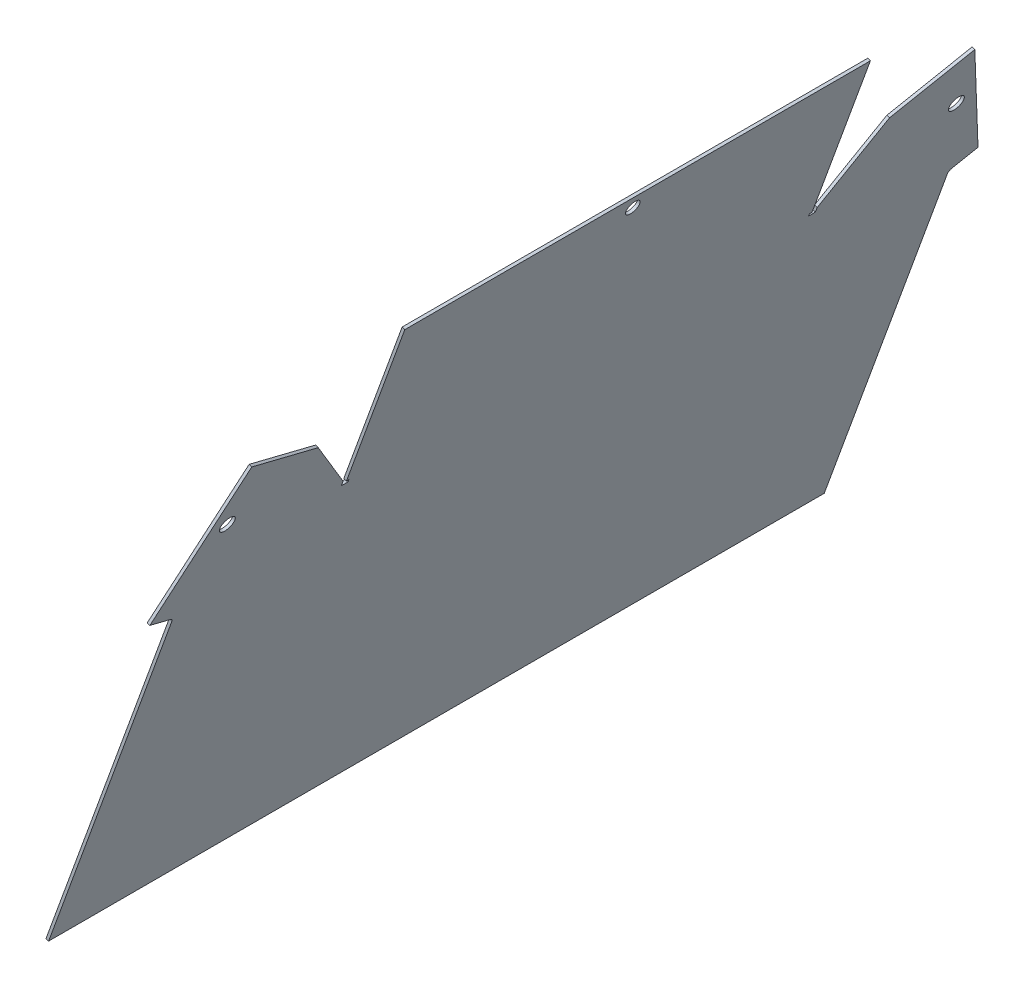
ISO-10303-21;
HEADER;
FILE_DESCRIPTION(('STEP AP214'),'2;1');
FILE_NAME('part.step','',(''),(''),'','','');
FILE_SCHEMA(('AUTOMOTIVE_DESIGN { 1 0 10303 214 1 1 1 1 }'));
ENDSEC;
DATA;
#1=APPLICATION_CONTEXT('core data for automotive mechanical design processes');
#2=APPLICATION_PROTOCOL_DEFINITION('international standard','automotive_design',2000,#1);
#3=PRODUCT_CONTEXT('',#1,'mechanical');
#4=PRODUCT('Part','Part','',(#3));
#5=PRODUCT_RELATED_PRODUCT_CATEGORY('part','',(#4));
#6=PRODUCT_DEFINITION_FORMATION('','',#4);
#7=PRODUCT_DEFINITION_CONTEXT('part definition',#1,'design');
#8=PRODUCT_DEFINITION('design','',#6,#7);
#9=PRODUCT_DEFINITION_SHAPE('','',#8);
#10=(LENGTH_UNIT() NAMED_UNIT(*) SI_UNIT(.MILLI.,.METRE.));
#11=(NAMED_UNIT(*) PLANE_ANGLE_UNIT() SI_UNIT($,.RADIAN.));
#12=(NAMED_UNIT(*) SI_UNIT($,.STERADIAN.) SOLID_ANGLE_UNIT());
#13=UNCERTAINTY_MEASURE_WITH_UNIT(LENGTH_MEASURE(1.E-05),#10,'distance_accuracy_value','');
#14=(GEOMETRIC_REPRESENTATION_CONTEXT(3) GLOBAL_UNCERTAINTY_ASSIGNED_CONTEXT((#13)) GLOBAL_UNIT_ASSIGNED_CONTEXT((#10,
#11,#12)) REPRESENTATION_CONTEXT('',''));
#15=CARTESIAN_POINT('',(0.,0.,0.));
#16=DIRECTION('',(0.,0.,1.));
#17=DIRECTION('',(1.,0.,0.));
#18=AXIS2_PLACEMENT_3D('',#15,#16,#17);
#19=CARTESIAN_POINT('',(-66.0897710828425,-21.492119605104,100.));
#20=DIRECTION('',(-0.342020143325664,-0.939692620785911,0.));
#21=DIRECTION('',(0.,0.,-1.));
#22=AXIS2_PLACEMENT_3D('',#19,#20,#21);
#23=PLANE('',#22);
#24=DIRECTION('',(0.939692620785911,-0.342020143325664,0.));
#25=VECTOR('',#24,1.);
#26=CARTESIAN_POINT('',(-66.0897710828425,-21.492119605104,-98.9));
#27=LINE('',#26,#25);
#28=CARTESIAN_POINT('',(-67.2174022277856,-21.0816954331132,-98.9));
#29=VERTEX_POINT('',#28);
#30=CARTESIAN_POINT('',(-66.0897710828425,-21.492119605104,-98.9));
#31=VERTEX_POINT('',#30);
#32=EDGE_CURVE('E65',#29,#31,#27,.T.);
#33=ORIENTED_EDGE('',*,*,#32,.F.);
#34=DIRECTION('',(0.,0.,1.));
#35=VECTOR('',#34,1.);
#36=CARTESIAN_POINT('',(-67.2174022277856,-21.0816954331132,100.));
#37=LINE('',#36,#35);
#38=CARTESIAN_POINT('',(-67.2174022277856,-21.0816954331132,-100.));
#39=VERTEX_POINT('',#38);
#40=EDGE_CURVE('E77',#29,#39,#37,.F.);
#41=ORIENTED_EDGE('',*,*,#40,.T.);
#42=DIRECTION('',(0.939692620785911,-0.342020143325664,0.));
#43=VECTOR('',#42,1.);
#44=CARTESIAN_POINT('',(-66.0897710828425,-21.492119605104,-100.));
#45=LINE('',#44,#43);
#46=CARTESIAN_POINT('',(-66.0897710828425,-21.492119605104,-100.));
#47=VERTEX_POINT('',#46);
#48=EDGE_CURVE('E328',#39,#47,#45,.T.);
#49=ORIENTED_EDGE('',*,*,#48,.T.);
#50=DIRECTION('',(0.,0.,-1.));
#51=VECTOR('',#50,1.);
#52=CARTESIAN_POINT('',(-66.0897710828425,-21.492119605104,100.));
#53=LINE('',#52,#51);
#54=EDGE_CURVE('E329',#31,#47,#53,.T.);
#55=ORIENTED_EDGE('',*,*,#54,.F.);
#56=EDGE_LOOP('',(#33,#41,#49,#55));
#57=FACE_BOUND('',#56,.T.);
#58=ADVANCED_FACE('F56',(#57),#23,.T.);
#59=CARTESIAN_POINT('',(-52.9994454834083,14.4732543926511,-100.));
#60=DIRECTION('',(0.,0.,1.));
#61=DIRECTION('',(-0.342020143325663,-0.939692620785911,0.));
#62=AXIS2_PLACEMENT_3D('',#59,#60,#61);
#63=PLANE('',#62);
#64=ORIENTED_EDGE('',*,*,#48,.F.);
#65=DIRECTION('',(0.342020143325664,0.939692620785911,0.));
#66=VECTOR('',#65,1.);
#67=CARTESIAN_POINT('',(-54.1270766283513,14.8836785646419,-100.));
#68=LINE('',#67,#66);
#69=CARTESIAN_POINT('',(-42.1503914713204,47.7893505935023,-100.));
#70=VERTEX_POINT('',#69);
#71=EDGE_CURVE('E281',#70,#39,#68,.F.);
#72=ORIENTED_EDGE('',*,*,#71,.F.);
#73=DIRECTION('',(0.93969262078591,-0.342020143325664,0.));
#74=VECTOR('',#73,1.);
#75=CARTESIAN_POINT('',(-41.0227603263773,47.3789264215115,-100.));
#76=LINE('',#75,#74);
#77=CARTESIAN_POINT('',(-41.0227603263773,47.3789264215115,-100.));
#78=VERTEX_POINT('',#77);
#79=EDGE_CURVE('E282',#70,#78,#76,.T.);
#80=ORIENTED_EDGE('',*,*,#79,.T.);
#81=DIRECTION('',(-0.342020143325663,-0.939692620785911,0.));
#82=VECTOR('',#81,1.);
#83=CARTESIAN_POINT('',(-52.9994454834083,14.4732543926511,-100.));
#84=LINE('',#83,#82);
#85=EDGE_CURVE('E312',#78,#47,#84,.T.);
#86=ORIENTED_EDGE('',*,*,#85,.T.);
#87=EDGE_LOOP('',(#64,#72,#80,#86));
#88=FACE_BOUND('',#87,.T.);
#89=ADVANCED_FACE('F352',(#88),#63,.F.);
#90=CARTESIAN_POINT('',(-52.9994454834083,14.4732543926511,100.));
#91=DIRECTION('',(0.,0.,1.));
#92=DIRECTION('',(-0.342020143325663,-0.939692620785911,0.));
#93=AXIS2_PLACEMENT_3D('',#90,#91,#92);
#94=PLANE('',#93);
#95=DIRECTION('',(-0.342020143325663,-0.939692620785911,0.));
#96=VECTOR('',#95,1.);
#97=CARTESIAN_POINT('',(-52.9994454834083,14.4732543926511,100.));
#98=LINE('',#97,#96);
#99=CARTESIAN_POINT('',(-41.0227603263773,47.3789264215115,100.));
#100=VERTEX_POINT('',#99);
#101=CARTESIAN_POINT('',(-66.0897710828425,-21.492119605104,100.));
#102=VERTEX_POINT('',#101);
#103=EDGE_CURVE('E306',#100,#102,#98,.T.);
#104=ORIENTED_EDGE('',*,*,#103,.F.);
#105=DIRECTION('',(0.93969262078591,-0.342020143325664,0.));
#106=VECTOR('',#105,1.);
#107=CARTESIAN_POINT('',(-41.0227603263773,47.3789264215115,100.));
#108=LINE('',#107,#106);
#109=CARTESIAN_POINT('',(-42.1503914713204,47.7893505935023,100.));
#110=VERTEX_POINT('',#109);
#111=EDGE_CURVE('E270',#110,#100,#108,.T.);
#112=ORIENTED_EDGE('',*,*,#111,.F.);
#113=DIRECTION('',(0.342020143325664,0.939692620785911,0.));
#114=VECTOR('',#113,1.);
#115=CARTESIAN_POINT('',(-54.1270766283513,14.8836785646419,100.));
#116=LINE('',#115,#114);
#117=CARTESIAN_POINT('',(-67.2174022277856,-21.0816954331132,100.));
#118=VERTEX_POINT('',#117);
#119=EDGE_CURVE('E317',#110,#118,#116,.F.);
#120=ORIENTED_EDGE('',*,*,#119,.T.);
#121=DIRECTION('',(0.939692620785911,-0.342020143325664,0.));
#122=VECTOR('',#121,1.);
#123=CARTESIAN_POINT('',(-66.0897710828425,-21.492119605104,100.));
#124=LINE('',#123,#122);
#125=EDGE_CURVE('E325',#118,#102,#124,.T.);
#126=ORIENTED_EDGE('',*,*,#125,.T.);
#127=EDGE_LOOP('',(#104,#112,#120,#126));
#128=FACE_BOUND('',#127,.T.);
#129=ADVANCED_FACE('F646',(#128),#94,.T.);
#130=ORIENTED_EDGE('',*,*,#125,.F.);
#131=DIRECTION('',(0.,0.,1.));
#132=VECTOR('',#131,1.);
#133=CARTESIAN_POINT('',(-67.2174022277856,-21.0816954331132,100.));
#134=LINE('',#133,#132);
#135=CARTESIAN_POINT('',(-67.2174022277856,-21.0816954331132,98.9));
#136=VERTEX_POINT('',#135);
#137=EDGE_CURVE('E314',#118,#136,#134,.F.);
#138=ORIENTED_EDGE('',*,*,#137,.T.);
#139=DIRECTION('',(0.939692620785908,-0.34202014332567,0.));
#140=VECTOR('',#139,1.);
#141=CARTESIAN_POINT('',(-66.0897710828425,-21.492119605104,98.9));
#142=LINE('',#141,#140);
#143=CARTESIAN_POINT('',(-66.0897710828425,-21.492119605104,98.9));
#144=VERTEX_POINT('',#143);
#145=EDGE_CURVE('E332',#136,#144,#142,.T.);
#146=ORIENTED_EDGE('',*,*,#145,.T.);
#147=EDGE_CURVE('E311',#102,#144,#53,.T.);
#148=ORIENTED_EDGE('',*,*,#147,.F.);
#149=EDGE_LOOP('',(#130,#138,#146,#148));
#150=FACE_BOUND('',#149,.T.);
#151=ADVANCED_FACE('F378',(#150),#23,.T.);
#152=CARTESIAN_POINT('',(-66.3364356278653,-22.1698248727339,100.));
#153=DIRECTION('',(0.93969262078591,-0.342020143325666,0.));
#154=DIRECTION('',(0.342020143325666,0.93969262078591,0.));
#155=AXIS2_PLACEMENT_3D('',#152,#153,#154);
#156=PLANE('',#155);
#157=ORIENTED_EDGE('',*,*,#85,.F.);
#158=DIRECTION('',(0.,0.,-1.));
#159=VECTOR('',#158,1.);
#160=CARTESIAN_POINT('',(-41.0227603263773,47.3789264215115,100.));
#161=LINE('',#160,#159);
#162=EDGE_CURVE('E294',#100,#78,#161,.T.);
#163=ORIENTED_EDGE('',*,*,#162,.F.);
#164=ORIENTED_EDGE('',*,*,#103,.T.);
#165=ORIENTED_EDGE('',*,*,#147,.T.);
#166=DIRECTION('',(0.342020143325666,0.93969262078591,0.));
#167=VECTOR('',#166,1.);
#168=CARTESIAN_POINT('',(-66.2778064775316,-22.0087426060704,98.9));
#169=LINE('',#168,#167);
#170=CARTESIAN_POINT('',(-66.4658418722206,-22.5253656070367,98.9));
#171=VERTEX_POINT('',#170);
#172=EDGE_CURVE('E264',#144,#171,#169,.F.);
#173=ORIENTED_EDGE('',*,*,#172,.T.);
#174=DIRECTION('',(0.,0.,-1.));
#175=VECTOR('',#174,1.);
#176=CARTESIAN_POINT('',(-66.4658418722206,-22.5253656070367,100.527433388231));
#177=LINE('',#176,#175);
#178=CARTESIAN_POINT('',(-66.4658418722206,-22.5253656070367,101.827433388231));
#179=VERTEX_POINT('',#178);
#180=EDGE_CURVE('E273',#179,#171,#177,.T.);
#181=ORIENTED_EDGE('',*,*,#180,.F.);
#182=DIRECTION('',(-0.342020143325668,-0.939692620785909,0.));
#183=VECTOR('',#182,1.);
#184=CARTESIAN_POINT('',(-66.4658418722206,-22.5253656070367,101.827433388231));
#185=LINE('',#184,#183);
#186=CARTESIAN_POINT('',(-65.7014436261222,-20.4251986864106,101.827433388231));
#187=VERTEX_POINT('',#186);
#188=EDGE_CURVE('E391',#187,#179,#185,.T.);
#189=ORIENTED_EDGE('',*,*,#188,.F.);
#190=DIRECTION('',(-0.280166499593235,-0.769751131320058,-0.573576436351046));
#191=VECTOR('',#190,1.);
#192=CARTESIAN_POINT('',(-65.7014436261222,-20.4251986864106,101.827433388231));
#193=LINE('',#192,#191);
#194=CARTESIAN_POINT('',(-55.5074652630726,7.5825266804774,122.697258260965));
#195=VERTEX_POINT('',#194);
#196=EDGE_CURVE('E422',#195,#187,#193,.T.);
#197=ORIENTED_EDGE('',*,*,#196,.F.);
#198=DIRECTION('',(-0.116977778440511,-0.321393804843271,-0.939692620785908));
#199=VECTOR('',#198,1.);
#200=CARTESIAN_POINT('',(-55.5074652630726,7.58252668047739,122.697258260965));
#201=LINE('',#200,#199);
#202=CARTESIAN_POINT('',(-51.4513023898988,18.7267425841526,155.280765756497));
#203=VERTEX_POINT('',#202);
#204=EDGE_CURVE('E430',#203,#195,#201,.T.);
#205=ORIENTED_EDGE('',*,*,#204,.F.);
#206=DIRECTION('',(0.321393804843269,0.88302222155949,-0.342020143325668));
#207=VECTOR('',#206,1.);
#208=CARTESIAN_POINT('',(-51.4513023898988,18.7267425841526,155.280765756497));
#209=LINE('',#208,#207);
#210=CARTESIAN_POINT('',(-72.6632935095545,-39.5527240387739,177.854095215992));
#211=VERTEX_POINT('',#210);
#212=EDGE_CURVE('E438',#211,#203,#209,.T.);
#213=ORIENTED_EDGE('',*,*,#212,.F.);
#214=DIRECTION('',(-0.11697777844051,-0.321393804843269,-0.939692620785909));
#215=VECTOR('',#214,1.);
#216=CARTESIAN_POINT('',(-72.6632935095545,-39.5527240387738,177.854095215992));
#217=LINE('',#216,#215);
#218=CARTESIAN_POINT('',(-73.9032094063065,-42.9593649671227,167.89374347991));
#219=VERTEX_POINT('',#218);
#220=EDGE_CURVE('E450',#211,#219,#217,.T.);
#221=ORIENTED_EDGE('',*,*,#220,.T.);
#222=CARTESIAN_POINT('',(-74.545997015993,-44.7254094102417,168.577783766561));
#223=DIRECTION('',(-0.939692620785909,0.342020143325668,0.));
#224=DIRECTION('',(0.11697777844051,0.321393804843269,0.939692620785909));
#225=AXIS2_PLACEMENT_3D('',#222,#223,#224);
#226=CIRCLE('',#225,2.);
#227=CARTESIAN_POINT('',(-74.545997015993,-44.7254094102417,166.577783766561));
#228=VERTEX_POINT('',#227);
#229=EDGE_CURVE('E460',#219,#228,#226,.T.);
#230=ORIENTED_EDGE('',*,*,#229,.T.);
#231=DIRECTION('',(-0.342020143325668,-0.939692620785909,0.));
#232=VECTOR('',#231,1.);
#233=CARTESIAN_POINT('',(-51.4513023898988,18.7267425841526,166.577783766561));
#234=LINE('',#233,#232);
#235=CARTESIAN_POINT('',(-127.421623785874,-190.,166.577783766561));
#236=VERTEX_POINT('',#235);
#237=EDGE_CURVE('E456',#228,#236,#234,.T.);
#238=ORIENTED_EDGE('',*,*,#237,.T.);
#239=DIRECTION('',(0.,0.,1.));
#240=VECTOR('',#239,1.);
#241=CARTESIAN_POINT('',(-127.421623785874,-190.,236.126693153945));
#242=LINE('',#241,#240);
#243=CARTESIAN_POINT('',(-127.421623785873,-190.,-166.577783766561));
#244=VERTEX_POINT('',#243);
#245=EDGE_CURVE('E411',#244,#236,#242,.T.);
#246=ORIENTED_EDGE('',*,*,#245,.F.);
#247=DIRECTION('',(0.342020143325663,0.939692620785911,0.));
#248=VECTOR('',#247,1.);
#249=CARTESIAN_POINT('',(-51.4513023898989,18.7267425841523,-166.577783766562));
#250=LINE('',#249,#248);
#251=CARTESIAN_POINT('',(-74.5459970159929,-44.7254094102421,-166.577783766561));
#252=VERTEX_POINT('',#251);
#253=EDGE_CURVE('E530',#244,#252,#250,.T.);
#254=ORIENTED_EDGE('',*,*,#253,.T.);
#255=CARTESIAN_POINT('',(-74.5459970159929,-44.7254094102421,-168.577783766561));
#256=DIRECTION('',(-0.939692620785911,0.342020143325662,0.));
#257=DIRECTION('',(-0.116977778440517,-0.321393804843261,0.939692620785911));
#258=AXIS2_PLACEMENT_3D('',#255,#256,#257);
#259=CIRCLE('',#258,2.);
#260=CARTESIAN_POINT('',(-73.9032094063063,-42.9593649671231,-167.89374347991));
#261=VERTEX_POINT('',#260);
#262=EDGE_CURVE('E541',#252,#261,#259,.T.);
#263=ORIENTED_EDGE('',*,*,#262,.T.);
#264=DIRECTION('',(0.116977778440517,0.321393804843261,-0.939692620785911));
#265=VECTOR('',#264,1.);
#266=CARTESIAN_POINT('',(-72.6632935095543,-39.5527240387743,-177.854095215992));
#267=LINE('',#266,#265);
#268=CARTESIAN_POINT('',(-72.6632935095543,-39.5527240387743,-177.854095215992));
#269=VERTEX_POINT('',#268);
#270=EDGE_CURVE('E546',#261,#269,#267,.T.);
#271=ORIENTED_EDGE('',*,*,#270,.T.);
#272=DIRECTION('',(-0.321393804843261,-0.883022221559495,-0.342020143325663));
#273=VECTOR('',#272,1.);
#274=CARTESIAN_POINT('',(-51.4513023898991,18.7267425841523,-155.280765756498));
#275=LINE('',#274,#273);
#276=CARTESIAN_POINT('',(-51.451302389899,18.7267425841524,-155.280765756498));
#277=VERTEX_POINT('',#276);
#278=EDGE_CURVE('E552',#269,#277,#275,.F.);
#279=ORIENTED_EDGE('',*,*,#278,.T.);
#280=DIRECTION('',(0.116977778440518,0.321393804843263,-0.93969262078591));
#281=VECTOR('',#280,1.);
#282=CARTESIAN_POINT('',(-51.451302389899,18.7267425841525,-155.280765756498));
#283=LINE('',#282,#281);
#284=CARTESIAN_POINT('',(-55.5074652630731,7.5825266804775,-122.697258260965));
#285=VERTEX_POINT('',#284);
#286=EDGE_CURVE('E557',#277,#285,#283,.F.);
#287=ORIENTED_EDGE('',*,*,#286,.T.);
#288=DIRECTION('',(0.280166499593236,0.769751131320054,-0.573576436351051));
#289=VECTOR('',#288,1.);
#290=CARTESIAN_POINT('',(-47.5496703983043,29.4463883800816,-138.989012008732));
#291=LINE('',#290,#289);
#292=CARTESIAN_POINT('',(-65.7014436261227,-20.4251986864103,-101.827433388231));
#293=VERTEX_POINT('',#292);
#294=EDGE_CURVE('E563',#285,#293,#291,.F.);
#295=ORIENTED_EDGE('',*,*,#294,.T.);
#296=DIRECTION('',(0.342020143325663,0.939692620785911,0.));
#297=VECTOR('',#296,1.);
#298=CARTESIAN_POINT('',(-51.4513023898996,18.7267425841527,-101.827433388231));
#299=LINE('',#298,#297);
#300=CARTESIAN_POINT('',(-66.4658418722211,-22.5253656070365,-101.827433388231));
#301=VERTEX_POINT('',#300);
#302=EDGE_CURVE('E569',#293,#301,#299,.F.);
#303=ORIENTED_EDGE('',*,*,#302,.T.);
#304=DIRECTION('',(0.,0.,1.));
#305=VECTOR('',#304,1.);
#306=CARTESIAN_POINT('',(-66.4658418722207,-22.5253656070366,-100.313716694115));
#307=LINE('',#306,#305);
#308=CARTESIAN_POINT('',(-66.4658418722207,-22.5253656070366,-98.9));
#309=VERTEX_POINT('',#308);
#310=EDGE_CURVE('E227',#301,#309,#307,.T.);
#311=ORIENTED_EDGE('',*,*,#310,.T.);
#312=DIRECTION('',(0.342020143325666,0.93969262078591,0.));
#313=VECTOR('',#312,1.);
#314=CARTESIAN_POINT('',(-66.2778064775316,-22.0087426060704,-98.9));
#315=LINE('',#314,#313);
#316=EDGE_CURVE('E258',#309,#31,#315,.T.);
#317=ORIENTED_EDGE('',*,*,#316,.T.);
#318=ORIENTED_EDGE('',*,*,#54,.T.);
#319=EDGE_LOOP('',(#157,#163,#164,#165,#173,#181,#189,#197,#205,#213,#221,#230,#238,#246,#254,
#263,#271,#279,#287,#295,#303,#311,#317,#318));
#320=FACE_BOUND('',#319,.T.);
#321=CARTESIAN_POINT('',(-43.0748811863313,41.740770696796,0.));
#322=DIRECTION('',(0.93969262078591,-0.342020143325664,0.));
#323=DIRECTION('',(0.342020143325664,0.93969262078591,0.));
#324=AXIS2_PLACEMENT_3D('',#321,#322,#323);
#325=CIRCLE('',#324,3.);
#326=CARTESIAN_POINT('',(-42.0488207563543,44.5598485591537,0.));
#327=VERTEX_POINT('',#326);
#328=EDGE_CURVE('E286',#327,#327,#325,.F.);
#329=ORIENTED_EDGE('',*,*,#328,.T.);
#330=EDGE_LOOP('',(#329));
#331=FACE_BOUND('',#330,.T.);
#332=CARTESIAN_POINT('',(-60.6701006429815,-6.60169745070006,156.577783766561));
#333=DIRECTION('',(-0.939692620785909,0.342020143325668,0.));
#334=DIRECTION('',(0.11697777844051,0.321393804843269,0.939692620785909));
#335=AXIS2_PLACEMENT_3D('',#332,#333,#334);
#336=CIRCLE('',#335,3.25);
#337=CARTESIAN_POINT('',(-60.2899228630499,-5.55716758495943,159.631784784115));
#338=VERTEX_POINT('',#337);
#339=EDGE_CURVE('E520',#338,#338,#336,.T.);
#340=ORIENTED_EDGE('',*,*,#339,.T.);
#341=EDGE_LOOP('',(#340));
#342=FACE_BOUND('',#341,.T.);
#343=CARTESIAN_POINT('',(-60.6701006429816,-6.60169745070029,-156.577783766562));
#344=DIRECTION('',(-0.939692620785911,0.342020143325662,0.));
#345=DIRECTION('',(-0.116977778440517,-0.321393804843261,0.939692620785911));
#346=AXIS2_PLACEMENT_3D('',#343,#344,#345);
#347=CIRCLE('',#346,3.25);
#348=CARTESIAN_POINT('',(-61.0502784229133,-7.64622731644089,-153.523782749007));
#349=VERTEX_POINT('',#348);
#350=EDGE_CURVE('E527',#349,#349,#347,.T.);
#351=ORIENTED_EDGE('',*,*,#350,.T.);
#352=EDGE_LOOP('',(#351));
#353=FACE_BOUND('',#352,.T.);
#354=ADVANCED_FACE('F58',(#320,#331,#342,#353),#156,.T.);
#355=CARTESIAN_POINT('',(-54.1270766283513,14.8836785646419,100.));
#356=DIRECTION('',(0.939692620785911,-0.342020143325664,0.));
#357=DIRECTION('',(0.342020143325664,0.939692620785911,0.));
#358=AXIS2_PLACEMENT_3D('',#355,#356,#357);
#359=PLANE('',#358);
#360=ORIENTED_EDGE('',*,*,#71,.T.);
#361=ORIENTED_EDGE('',*,*,#40,.F.);
#362=DIRECTION('',(0.342020143325666,0.93969262078591,0.));
#363=VECTOR('',#362,1.);
#364=CARTESIAN_POINT('',(-67.4054376224747,-21.5983184340796,-98.9));
#365=LINE('',#364,#363);
#366=CARTESIAN_POINT('',(-67.5934730171637,-22.1149414350459,-98.9000000000001));
#367=VERTEX_POINT('',#366);
#368=EDGE_CURVE('E72',#367,#29,#365,.T.);
#369=ORIENTED_EDGE('',*,*,#368,.F.);
#370=DIRECTION('',(0.,0.,1.));
#371=VECTOR('',#370,1.);
#372=CARTESIAN_POINT('',(-67.5934730171638,-22.1149414350458,-100.313716694115));
#373=LINE('',#372,#371);
#374=CARTESIAN_POINT('',(-67.5934730171642,-22.1149414350457,-101.827433388231));
#375=VERTEX_POINT('',#374);
#376=EDGE_CURVE('E217',#375,#367,#373,.T.);
#377=ORIENTED_EDGE('',*,*,#376,.F.);
#378=DIRECTION('',(0.342020143325663,0.939692620785911,0.));
#379=VECTOR('',#378,1.);
#380=CARTESIAN_POINT('',(-52.5789335348427,19.1371667561435,-101.827433388231));
#381=LINE('',#380,#379);
#382=CARTESIAN_POINT('',(-66.8290747710658,-20.0147745144195,-101.827433388231));
#383=VERTEX_POINT('',#382);
#384=EDGE_CURVE('E223',#383,#375,#381,.F.);
#385=ORIENTED_EDGE('',*,*,#384,.F.);
#386=DIRECTION('',(0.280166499593236,0.769751131320054,-0.573576436351051));
#387=VECTOR('',#386,1.);
#388=CARTESIAN_POINT('',(-48.6773015432474,29.8568125520724,-138.989012008732));
#389=LINE('',#388,#387);
#390=CARTESIAN_POINT('',(-56.6350964080162,7.9929508524683,-122.697258260965));
#391=VERTEX_POINT('',#390);
#392=EDGE_CURVE('E238',#391,#383,#389,.F.);
#393=ORIENTED_EDGE('',*,*,#392,.F.);
#394=DIRECTION('',(0.116977778440517,0.321393804843261,-0.939692620785911));
#395=VECTOR('',#394,1.);
#396=CARTESIAN_POINT('',(-52.5789335348421,19.1371667561433,-155.280765756498));
#397=LINE('',#396,#395);
#398=CARTESIAN_POINT('',(-52.5789335348421,19.1371667561432,-155.280765756498));
#399=VERTEX_POINT('',#398);
#400=EDGE_CURVE('E1220',#399,#391,#397,.F.);
#401=ORIENTED_EDGE('',*,*,#400,.F.);
#402=DIRECTION('',(-0.321393804843261,-0.883022221559495,-0.342020143325662));
#403=VECTOR('',#402,1.);
#404=CARTESIAN_POINT('',(-52.5789335348421,19.1371667561433,-155.280765756499));
#405=LINE('',#404,#403);
#406=CARTESIAN_POINT('',(-73.7909246544974,-39.1422998667835,-177.854095215992));
#407=VERTEX_POINT('',#406);
#408=EDGE_CURVE('E1213',#407,#399,#405,.F.);
#409=ORIENTED_EDGE('',*,*,#408,.F.);
#410=DIRECTION('',(0.116977778440517,0.321393804843261,-0.939692620785911));
#411=VECTOR('',#410,1.);
#412=CARTESIAN_POINT('',(-73.7909246544974,-39.1422998667835,-177.854095215992));
#413=LINE('',#412,#411);
#414=CARTESIAN_POINT('',(-75.0308405512494,-42.5489407951323,-167.89374347991));
#415=VERTEX_POINT('',#414);
#416=EDGE_CURVE('E1206',#415,#407,#413,.T.);
#417=ORIENTED_EDGE('',*,*,#416,.F.);
#418=CARTESIAN_POINT('',(-75.6736281609359,-44.3149852382513,-168.577783766561));
#419=DIRECTION('',(-0.939692620785911,0.342020143325662,0.));
#420=DIRECTION('',(-0.116977778440517,-0.321393804843261,0.939692620785911));
#421=AXIS2_PLACEMENT_3D('',#418,#419,#420);
#422=CIRCLE('',#421,2.);
#423=CARTESIAN_POINT('',(-75.673628160936,-44.3149852382513,-166.577783766561));
#424=VERTEX_POINT('',#423);
#425=EDGE_CURVE('E1199',#424,#415,#422,.T.);
#426=ORIENTED_EDGE('',*,*,#425,.F.);
#427=DIRECTION('',(0.342020143325663,0.939692620785911,0.));
#428=VECTOR('',#427,1.);
#429=CARTESIAN_POINT('',(-52.578933534842,19.1371667561431,-166.577783766562));
#430=LINE('',#429,#428);
#431=CARTESIAN_POINT('',(-128.549254930816,-189.58957582801,-166.577783766561));
#432=VERTEX_POINT('',#431);
#433=EDGE_CURVE('E1189',#432,#424,#430,.T.);
#434=ORIENTED_EDGE('',*,*,#433,.F.);
#435=DIRECTION('',(0.,0.,1.));
#436=VECTOR('',#435,1.);
#437=CARTESIAN_POINT('',(-128.549254930817,-189.589575828009,236.126693153945));
#438=LINE('',#437,#436);
#439=CARTESIAN_POINT('',(-128.549254930817,-189.589575828009,166.577783766561));
#440=VERTEX_POINT('',#439);
#441=EDGE_CURVE('E496',#432,#440,#438,.T.);
#442=ORIENTED_EDGE('',*,*,#441,.T.);
#443=DIRECTION('',(-0.342020143325668,-0.939692620785909,0.));
#444=VECTOR('',#443,1.);
#445=CARTESIAN_POINT('',(-52.5789335348419,19.1371667561434,166.577783766561));
#446=LINE('',#445,#444);
#447=CARTESIAN_POINT('',(-75.6736281609361,-44.3149852382509,166.577783766561));
#448=VERTEX_POINT('',#447);
#449=EDGE_CURVE('E426',#448,#440,#446,.T.);
#450=ORIENTED_EDGE('',*,*,#449,.F.);
#451=CARTESIAN_POINT('',(-75.6736281609361,-44.3149852382509,168.577783766561));
#452=DIRECTION('',(-0.939692620785909,0.342020143325668,0.));
#453=DIRECTION('',(0.11697777844051,0.321393804843269,0.939692620785909));
#454=AXIS2_PLACEMENT_3D('',#451,#452,#453);
#455=CIRCLE('',#454,2.);
#456=CARTESIAN_POINT('',(-75.0308405512496,-42.5489407951319,167.89374347991));
#457=VERTEX_POINT('',#456);
#458=EDGE_CURVE('E477',#457,#448,#455,.T.);
#459=ORIENTED_EDGE('',*,*,#458,.F.);
#460=DIRECTION('',(0.11697777844051,0.321393804843269,0.939692620785909));
#461=VECTOR('',#460,1.);
#462=CARTESIAN_POINT('',(-73.7909246544976,-39.142299866783,177.854095215992));
#463=LINE('',#462,#461);
#464=CARTESIAN_POINT('',(-73.7909246544977,-39.1422998667831,177.854095215992));
#465=VERTEX_POINT('',#464);
#466=EDGE_CURVE('E505',#465,#457,#463,.F.);
#467=ORIENTED_EDGE('',*,*,#466,.F.);
#468=DIRECTION('',(0.321393804843269,0.88302222155949,-0.342020143325668));
#469=VECTOR('',#468,1.);
#470=CARTESIAN_POINT('',(-52.5789335348419,19.1371667561433,155.280765756498));
#471=LINE('',#470,#469);
#472=CARTESIAN_POINT('',(-52.5789335348419,19.1371667561434,155.280765756497));
#473=VERTEX_POINT('',#472);
#474=EDGE_CURVE('E402',#465,#473,#471,.T.);
#475=ORIENTED_EDGE('',*,*,#474,.T.);
#476=DIRECTION('',(0.11697777844051,0.321393804843269,0.939692620785909));
#477=VECTOR('',#476,1.);
#478=CARTESIAN_POINT('',(-52.5789335348418,19.1371667561435,155.280765756498));
#479=LINE('',#478,#477);
#480=CARTESIAN_POINT('',(-56.6350964080156,7.9929508524682,122.697258260965));
#481=VERTEX_POINT('',#480);
#482=EDGE_CURVE('E408',#473,#481,#479,.F.);
#483=ORIENTED_EDGE('',*,*,#482,.T.);
#484=DIRECTION('',(-0.280166499593235,-0.769751131320058,-0.573576436351046));
#485=VECTOR('',#484,1.);
#486=CARTESIAN_POINT('',(-66.8290747710653,-20.0147745144198,101.827433388231));
#487=LINE('',#486,#485);
#488=CARTESIAN_POINT('',(-66.8290747710653,-20.0147745144198,101.827433388231));
#489=VERTEX_POINT('',#488);
#490=EDGE_CURVE('E612',#481,#489,#487,.T.);
#491=ORIENTED_EDGE('',*,*,#490,.T.);
#492=DIRECTION('',(-0.342020143325668,-0.939692620785909,0.));
#493=VECTOR('',#492,1.);
#494=CARTESIAN_POINT('',(-67.5934730171637,-22.1149414350459,101.827433388231));
#495=LINE('',#494,#493);
#496=CARTESIAN_POINT('',(-67.5934730171637,-22.1149414350459,101.827433388231));
#497=VERTEX_POINT('',#496);
#498=EDGE_CURVE('E616',#489,#497,#495,.T.);
#499=ORIENTED_EDGE('',*,*,#498,.T.);
#500=DIRECTION('',(0.,0.,-1.));
#501=VECTOR('',#500,1.);
#502=CARTESIAN_POINT('',(-67.5934730171637,-22.1149414350459,100.527433388231));
#503=LINE('',#502,#501);
#504=CARTESIAN_POINT('',(-67.5934730171637,-22.1149414350459,98.9));
#505=VERTEX_POINT('',#504);
#506=EDGE_CURVE('E621',#497,#505,#503,.T.);
#507=ORIENTED_EDGE('',*,*,#506,.T.);
#508=DIRECTION('',(0.342020143325666,0.93969262078591,0.));
#509=VECTOR('',#508,1.);
#510=CARTESIAN_POINT('',(-67.4054376224747,-21.5983184340796,98.9));
#511=LINE('',#510,#509);
#512=EDGE_CURVE('E265',#136,#505,#511,.F.);
#513=ORIENTED_EDGE('',*,*,#512,.F.);
#514=ORIENTED_EDGE('',*,*,#137,.F.);
#515=ORIENTED_EDGE('',*,*,#119,.F.);
#516=DIRECTION('',(0.,0.,1.));
#517=VECTOR('',#516,1.);
#518=CARTESIAN_POINT('',(-42.1503914713204,47.7893505935023,100.));
#519=LINE('',#518,#517);
#520=EDGE_CURVE('E277',#110,#70,#519,.F.);
#521=ORIENTED_EDGE('',*,*,#520,.T.);
#522=EDGE_LOOP('',(#360,#361,#369,#377,#385,#393,#401,#409,#417,#426,#434,#442,#450,#459,#467,
#475,#483,#491,#499,#507,#513,#514,#515,#521));
#523=FACE_BOUND('',#522,.T.);
#524=CARTESIAN_POINT('',(-44.2025123312744,42.1511948687868,0.));
#525=DIRECTION('',(0.93969262078591,-0.342020143325664,0.));
#526=DIRECTION('',(0.342020143325664,0.93969262078591,0.));
#527=AXIS2_PLACEMENT_3D('',#524,#525,#526);
#528=CIRCLE('',#527,3.);
#529=CARTESIAN_POINT('',(-43.1764519012974,44.9702727311445,0.));
#530=VERTEX_POINT('',#529);
#531=EDGE_CURVE('E290',#530,#530,#528,.F.);
#532=ORIENTED_EDGE('',*,*,#531,.F.);
#533=EDGE_LOOP('',(#532));
#534=FACE_BOUND('',#533,.T.);
#535=CARTESIAN_POINT('',(-61.7977317879246,-6.19127327870925,156.577783766561));
#536=DIRECTION('',(-0.939692620785909,0.342020143325668,0.));
#537=DIRECTION('',(0.11697777844051,0.321393804843269,0.939692620785909));
#538=AXIS2_PLACEMENT_3D('',#535,#536,#537);
#539=CIRCLE('',#538,3.25);
#540=CARTESIAN_POINT('',(-61.4175540079929,-5.14674341296863,159.631784784115));
#541=VERTEX_POINT('',#540);
#542=EDGE_CURVE('E470',#541,#541,#539,.T.);
#543=ORIENTED_EDGE('',*,*,#542,.F.);
#544=EDGE_LOOP('',(#543));
#545=FACE_BOUND('',#544,.T.);
#546=CARTESIAN_POINT('',(-61.7977317879247,-6.19127327870949,-156.577783766562));
#547=DIRECTION('',(-0.939692620785911,0.342020143325662,0.));
#548=DIRECTION('',(-0.116977778440517,-0.321393804843261,0.939692620785911));
#549=AXIS2_PLACEMENT_3D('',#546,#547,#548);
#550=CIRCLE('',#549,3.25);
#551=CARTESIAN_POINT('',(-62.1779095678564,-7.23580314445009,-153.523782749007));
#552=VERTEX_POINT('',#551);
#553=EDGE_CURVE('E531',#552,#552,#550,.T.);
#554=ORIENTED_EDGE('',*,*,#553,.F.);
#555=EDGE_LOOP('',(#554));
#556=FACE_BOUND('',#555,.T.);
#557=ADVANCED_FACE('F219',(#523,#534,#545,#556),#359,.F.);
#558=CARTESIAN_POINT('',(-41.0227603263773,47.3789264215115,100.));
#559=DIRECTION('',(-0.342020143325664,-0.93969262078591,0.));
#560=DIRECTION('',(0.,0.,-1.));
#561=AXIS2_PLACEMENT_3D('',#558,#559,#560);
#562=PLANE('',#561);
#563=ORIENTED_EDGE('',*,*,#79,.F.);
#564=ORIENTED_EDGE('',*,*,#520,.F.);
#565=ORIENTED_EDGE('',*,*,#111,.T.);
#566=ORIENTED_EDGE('',*,*,#162,.T.);
#567=EDGE_LOOP('',(#563,#564,#565,#566));
#568=FACE_BOUND('',#567,.T.);
#569=ADVANCED_FACE('F375',(#568),#562,.F.);
#570=CARTESIAN_POINT('',(-43.0748811863313,41.740770696796,0.));
#571=DIRECTION('',(0.93969262078591,-0.342020143325664,0.));
#572=DIRECTION('',(0.342020143325664,0.93969262078591,0.));
#573=AXIS2_PLACEMENT_3D('',#570,#571,#572);
#574=CYLINDRICAL_SURFACE('',#573,3.);
#575=ORIENTED_EDGE('',*,*,#328,.F.);
#576=EDGE_LOOP('',(#575));
#577=FACE_BOUND('',#576,.T.);
#578=ORIENTED_EDGE('',*,*,#531,.T.);
#579=EDGE_LOOP('',(#578));
#580=FACE_BOUND('',#579,.T.);
#581=ADVANCED_FACE('F736',(#577,#580),#574,.F.);
#582=CARTESIAN_POINT('',(-66.8416220500031,-21.803530520075,-98.9));
#583=DIRECTION('',(0.,0.,-1.));
#584=DIRECTION('',(0.342020143325666,0.93969262078591,0.));
#585=AXIS2_PLACEMENT_3D('',#582,#583,#584);
#586=PLANE('',#585);
#587=DIRECTION('',(0.939692620785909,-0.342020143325669,0.));
#588=VECTOR('',#587,1.);
#589=CARTESIAN_POINT('',(-66.4658418722206,-22.5253656070367,-98.9));
#590=LINE('',#589,#588);
#591=EDGE_CURVE('E13',#367,#309,#590,.T.);
#592=ORIENTED_EDGE('',*,*,#591,.F.);
#593=ORIENTED_EDGE('',*,*,#368,.T.);
#594=ORIENTED_EDGE('',*,*,#32,.T.);
#595=ORIENTED_EDGE('',*,*,#316,.F.);
#596=EDGE_LOOP('',(#592,#593,#594,#595));
#597=FACE_BOUND('',#596,.T.);
#598=ADVANCED_FACE('F751',(#597),#586,.T.);
#599=CARTESIAN_POINT('',(-66.8416220500031,-21.803530520075,98.9));
#600=DIRECTION('',(0.,0.,-1.));
#601=DIRECTION('',(0.342020143325666,0.93969262078591,0.));
#602=AXIS2_PLACEMENT_3D('',#599,#600,#601);
#603=PLANE('',#602);
#604=ORIENTED_EDGE('',*,*,#512,.T.);
#605=DIRECTION('',(0.939692620785913,-0.342020143325656,0.));
#606=VECTOR('',#605,1.);
#607=CARTESIAN_POINT('',(-66.4658418722206,-22.5253656070367,98.9));
#608=LINE('',#607,#606);
#609=EDGE_CURVE('E249',#505,#171,#608,.T.);
#610=ORIENTED_EDGE('',*,*,#609,.T.);
#611=ORIENTED_EDGE('',*,*,#172,.F.);
#612=ORIENTED_EDGE('',*,*,#145,.F.);
#613=EDGE_LOOP('',(#604,#610,#611,#612));
#614=FACE_BOUND('',#613,.T.);
#615=ADVANCED_FACE('F385',(#614),#603,.F.);
#616=CARTESIAN_POINT('',(-72.6632935095545,-39.5527240387738,177.854095215992));
#617=DIRECTION('',(0.321393804843269,0.88302222155949,-0.342020143325668));
#618=DIRECTION('',(-0.11697777844051,-0.321393804843269,-0.939692620785909));
#619=AXIS2_PLACEMENT_3D('',#616,#617,#618);
#620=PLANE('',#619);
#621=DIRECTION('',(0.939692620785909,-0.342020143325668,0.));
#622=VECTOR('',#621,1.);
#623=CARTESIAN_POINT('',(-72.6632935095545,-39.5527240387739,177.854095215992));
#624=LINE('',#623,#622);
#625=EDGE_CURVE('E443',#465,#211,#624,.T.);
#626=ORIENTED_EDGE('',*,*,#625,.F.);
#627=ORIENTED_EDGE('',*,*,#466,.T.);
#628=DIRECTION('',(0.939692620785909,-0.342020143325668,0.));
#629=VECTOR('',#628,1.);
#630=CARTESIAN_POINT('',(-73.9032094063065,-42.9593649671227,167.89374347991));
#631=LINE('',#630,#629);
#632=EDGE_CURVE('E501',#457,#219,#631,.T.);
#633=ORIENTED_EDGE('',*,*,#632,.T.);
#634=ORIENTED_EDGE('',*,*,#220,.F.);
#635=EDGE_LOOP('',(#626,#627,#633,#634));
#636=FACE_BOUND('',#635,.T.);
#637=ADVANCED_FACE('F600',(#636),#620,.F.);
#638=CARTESIAN_POINT('',(-51.4513023898988,18.7267425841526,155.280765756497));
#639=DIRECTION('',(0.11697777844051,0.321393804843269,0.939692620785909));
#640=DIRECTION('',(0.321393804843269,0.88302222155949,-0.342020143325668));
#641=AXIS2_PLACEMENT_3D('',#638,#639,#640);
#642=PLANE('',#641);
#643=DIRECTION('',(0.939692620785909,-0.342020143325668,0.));
#644=VECTOR('',#643,1.);
#645=CARTESIAN_POINT('',(-51.4513023898988,18.7267425841526,155.280765756497));
#646=LINE('',#645,#644);
#647=EDGE_CURVE('E435',#473,#203,#646,.T.);
#648=ORIENTED_EDGE('',*,*,#647,.F.);
#649=ORIENTED_EDGE('',*,*,#474,.F.);
#650=ORIENTED_EDGE('',*,*,#625,.T.);
#651=ORIENTED_EDGE('',*,*,#212,.T.);
#652=EDGE_LOOP('',(#648,#649,#650,#651));
#653=FACE_BOUND('',#652,.T.);
#654=ADVANCED_FACE('F605',(#653),#642,.T.);
#655=CARTESIAN_POINT('',(-55.5074652630726,7.58252668047739,122.697258260965));
#656=DIRECTION('',(0.321393804843269,0.88302222155949,-0.342020143325669));
#657=DIRECTION('',(-0.116977778440511,-0.321393804843271,-0.939692620785908));
#658=AXIS2_PLACEMENT_3D('',#655,#656,#657);
#659=PLANE('',#658);
#660=DIRECTION('',(0.939692620785909,-0.342020143325668,0.));
#661=VECTOR('',#660,1.);
#662=CARTESIAN_POINT('',(-55.5074652630726,7.5825266804774,122.697258260965));
#663=LINE('',#662,#661);
#664=EDGE_CURVE('E427',#481,#195,#663,.T.);
#665=ORIENTED_EDGE('',*,*,#664,.F.);
#666=ORIENTED_EDGE('',*,*,#482,.F.);
#667=ORIENTED_EDGE('',*,*,#647,.T.);
#668=ORIENTED_EDGE('',*,*,#204,.T.);
#669=EDGE_LOOP('',(#665,#666,#667,#668));
#670=FACE_BOUND('',#669,.T.);
#671=ADVANCED_FACE('F607',(#670),#659,.T.);
#672=CARTESIAN_POINT('',(-65.7014436261222,-20.4251986864106,101.827433388231));
#673=DIRECTION('',(0.19617469496901,0.538985544695757,-0.819152044288992));
#674=DIRECTION('',(-0.280166499593235,-0.769751131320058,-0.573576436351046));
#675=AXIS2_PLACEMENT_3D('',#672,#673,#674);
#676=PLANE('',#675);
#677=DIRECTION('',(0.939692620785909,-0.342020143325668,0.));
#678=VECTOR('',#677,1.);
#679=CARTESIAN_POINT('',(-65.7014436261222,-20.4251986864106,101.827433388231));
#680=LINE('',#679,#678);
#681=EDGE_CURVE('E400',#489,#187,#680,.T.);
#682=ORIENTED_EDGE('',*,*,#681,.F.);
#683=ORIENTED_EDGE('',*,*,#490,.F.);
#684=ORIENTED_EDGE('',*,*,#664,.T.);
#685=ORIENTED_EDGE('',*,*,#196,.T.);
#686=EDGE_LOOP('',(#682,#683,#684,#685));
#687=FACE_BOUND('',#686,.T.);
#688=ADVANCED_FACE('F609',(#687),#676,.T.);
#689=CARTESIAN_POINT('',(-51.4513023898988,18.7267425841526,166.577783766561));
#690=DIRECTION('',(0.,0.,-1.));
#691=DIRECTION('',(-0.342020143325668,-0.939692620785909,0.));
#692=AXIS2_PLACEMENT_3D('',#689,#690,#691);
#693=PLANE('',#692);
#694=DIRECTION('',(0.939692620785909,-0.342020143325668,0.));
#695=VECTOR('',#694,1.);
#696=CARTESIAN_POINT('',(-74.545997015993,-44.7254094102417,166.577783766561));
#697=LINE('',#696,#695);
#698=EDGE_CURVE('E474',#448,#228,#697,.T.);
#699=ORIENTED_EDGE('',*,*,#698,.F.);
#700=ORIENTED_EDGE('',*,*,#449,.T.);
#701=DIRECTION('',(0.939692620785909,-0.342020143325668,0.));
#702=VECTOR('',#701,1.);
#703=CARTESIAN_POINT('',(-127.421623785874,-190.,166.577783766561));
#704=LINE('',#703,#702);
#705=EDGE_CURVE('E480',#440,#236,#704,.T.);
#706=ORIENTED_EDGE('',*,*,#705,.T.);
#707=ORIENTED_EDGE('',*,*,#237,.F.);
#708=EDGE_LOOP('',(#699,#700,#706,#707));
#709=FACE_BOUND('',#708,.T.);
#710=ADVANCED_FACE('F490',(#709),#693,.F.);
#711=CARTESIAN_POINT('',(-74.545997015993,-44.7254094102417,168.577783766561));
#712=DIRECTION('',(-0.939692620785909,0.342020143325668,0.));
#713=DIRECTION('',(0.11697777844051,0.321393804843269,0.939692620785909));
#714=AXIS2_PLACEMENT_3D('',#711,#712,#713);
#715=CYLINDRICAL_SURFACE('',#714,2.);
#716=ORIENTED_EDGE('',*,*,#632,.F.);
#717=ORIENTED_EDGE('',*,*,#458,.T.);
#718=ORIENTED_EDGE('',*,*,#698,.T.);
#719=ORIENTED_EDGE('',*,*,#229,.F.);
#720=EDGE_LOOP('',(#716,#717,#718,#719));
#721=FACE_BOUND('',#720,.T.);
#722=ADVANCED_FACE('F498',(#721),#715,.F.);
#723=CARTESIAN_POINT('',(-60.6701006429815,-6.60169745070006,156.577783766561));
#724=DIRECTION('',(-0.939692620785909,0.342020143325668,0.));
#725=DIRECTION('',(0.11697777844051,0.321393804843269,0.939692620785909));
#726=AXIS2_PLACEMENT_3D('',#723,#724,#725);
#727=CYLINDRICAL_SURFACE('',#726,3.25);
#728=ORIENTED_EDGE('',*,*,#339,.F.);
#729=EDGE_LOOP('',(#728));
#730=FACE_BOUND('',#729,.T.);
#731=ORIENTED_EDGE('',*,*,#542,.T.);
#732=EDGE_LOOP('',(#731));
#733=FACE_BOUND('',#732,.T.);
#734=ADVANCED_FACE('F828',(#730,#733),#727,.F.);
#735=CARTESIAN_POINT('',(-127.421623785874,-190.,236.126693153945));
#736=DIRECTION('',(-0.342020143325668,-0.939692620785909,0.));
#737=DIRECTION('',(0.,0.,1.));
#738=AXIS2_PLACEMENT_3D('',#735,#736,#737);
#739=PLANE('',#738);
#740=ORIENTED_EDGE('',*,*,#705,.F.);
#741=ORIENTED_EDGE('',*,*,#441,.F.);
#742=DIRECTION('',(0.939692620785911,-0.342020143325662,0.));
#743=VECTOR('',#742,1.);
#744=CARTESIAN_POINT('',(-127.421623785873,-190.,-166.577783766561));
#745=LINE('',#744,#743);
#746=EDGE_CURVE('E228',#432,#244,#745,.T.);
#747=ORIENTED_EDGE('',*,*,#746,.T.);
#748=ORIENTED_EDGE('',*,*,#245,.T.);
#749=EDGE_LOOP('',(#740,#741,#747,#748));
#750=FACE_BOUND('',#749,.T.);
#751=ADVANCED_FACE('F638',(#750),#739,.T.);
#752=CARTESIAN_POINT('',(-66.4658418722206,-22.5253656070367,101.827433388231));
#753=DIRECTION('',(0.,0.,-1.));
#754=DIRECTION('',(-0.342020143325668,-0.939692620785909,0.));
#755=AXIS2_PLACEMENT_3D('',#752,#753,#754);
#756=PLANE('',#755);
#757=DIRECTION('',(0.939692620785909,-0.342020143325668,0.));
#758=VECTOR('',#757,1.);
#759=CARTESIAN_POINT('',(-66.4658418722206,-22.5253656070367,101.827433388231));
#760=LINE('',#759,#758);
#761=EDGE_CURVE('E395',#497,#179,#760,.T.);
#762=ORIENTED_EDGE('',*,*,#761,.F.);
#763=ORIENTED_EDGE('',*,*,#498,.F.);
#764=ORIENTED_EDGE('',*,*,#681,.T.);
#765=ORIENTED_EDGE('',*,*,#188,.T.);
#766=EDGE_LOOP('',(#762,#763,#764,#765));
#767=FACE_BOUND('',#766,.T.);
#768=ADVANCED_FACE('F397',(#767),#756,.T.);
#769=CARTESIAN_POINT('',(-66.4658418722206,-22.5253656070367,100.527433388231));
#770=DIRECTION('',(0.342020143325668,0.939692620785909,0.));
#771=DIRECTION('',(0.,0.,-1.));
#772=AXIS2_PLACEMENT_3D('',#769,#770,#771);
#773=PLANE('',#772);
#774=ORIENTED_EDGE('',*,*,#506,.F.);
#775=ORIENTED_EDGE('',*,*,#761,.T.);
#776=ORIENTED_EDGE('',*,*,#180,.T.);
#777=ORIENTED_EDGE('',*,*,#609,.F.);
#778=EDGE_LOOP('',(#774,#775,#776,#777));
#779=FACE_BOUND('',#778,.T.);
#780=ADVANCED_FACE('F630',(#779),#773,.T.);
#781=CARTESIAN_POINT('',(-67.0296574446922,-22.3201535210413,-100.313716694115));
#782=DIRECTION('',(0.342020143325666,0.93969262078591,0.));
#783=DIRECTION('',(0.,0.,1.));
#784=AXIS2_PLACEMENT_3D('',#781,#782,#783);
#785=PLANE('',#784);
#786=ORIENTED_EDGE('',*,*,#376,.T.);
#787=ORIENTED_EDGE('',*,*,#591,.T.);
#788=ORIENTED_EDGE('',*,*,#310,.F.);
#789=DIRECTION('',(0.939692620785911,-0.342020143325662,0.));
#790=VECTOR('',#789,1.);
#791=CARTESIAN_POINT('',(-66.4658418722211,-22.5253656070365,-101.827433388231));
#792=LINE('',#791,#790);
#793=EDGE_CURVE('E231',#375,#301,#792,.T.);
#794=ORIENTED_EDGE('',*,*,#793,.F.);
#795=EDGE_LOOP('',(#786,#787,#788,#794));
#796=FACE_BOUND('',#795,.T.);
#797=ADVANCED_FACE('F232',(#796),#785,.T.);
#798=CARTESIAN_POINT('',(-51.4513023898996,18.7267425841527,-101.827433388231));
#799=DIRECTION('',(0.,0.,1.));
#800=DIRECTION('',(0.342020143325663,0.939692620785911,0.));
#801=AXIS2_PLACEMENT_3D('',#798,#799,#800);
#802=PLANE('',#801);
#803=DIRECTION('',(0.939692620785911,-0.342020143325662,0.));
#804=VECTOR('',#803,1.);
#805=CARTESIAN_POINT('',(-65.7014436261227,-20.4251986864103,-101.827433388231));
#806=LINE('',#805,#804);
#807=EDGE_CURVE('E241',#383,#293,#806,.T.);
#808=ORIENTED_EDGE('',*,*,#807,.F.);
#809=ORIENTED_EDGE('',*,*,#384,.T.);
#810=ORIENTED_EDGE('',*,*,#793,.T.);
#811=ORIENTED_EDGE('',*,*,#302,.F.);
#812=EDGE_LOOP('',(#808,#809,#810,#811));
#813=FACE_BOUND('',#812,.T.);
#814=ADVANCED_FACE('F240',(#813),#802,.T.);
#815=CARTESIAN_POINT('',(-47.5496703983043,29.4463883800816,-138.989012008732));
#816=DIRECTION('',(0.196174694969,0.538985544695765,0.819152044288989));
#817=DIRECTION('',(0.280166499593236,0.769751131320054,-0.573576436351051));
#818=AXIS2_PLACEMENT_3D('',#815,#816,#817);
#819=PLANE('',#818);
#820=DIRECTION('',(0.939692620785911,-0.342020143325662,0.));
#821=VECTOR('',#820,1.);
#822=CARTESIAN_POINT('',(-55.5074652630731,7.5825266804775,-122.697258260965));
#823=LINE('',#822,#821);
#824=EDGE_CURVE('E1217',#391,#285,#823,.T.);
#825=ORIENTED_EDGE('',*,*,#824,.F.);
#826=ORIENTED_EDGE('',*,*,#392,.T.);
#827=ORIENTED_EDGE('',*,*,#807,.T.);
#828=ORIENTED_EDGE('',*,*,#294,.F.);
#829=EDGE_LOOP('',(#825,#826,#827,#828));
#830=FACE_BOUND('',#829,.T.);
#831=ADVANCED_FACE('F877',(#830),#819,.T.);
#832=CARTESIAN_POINT('',(-51.451302389899,18.7267425841525,-155.280765756498));
#833=DIRECTION('',(0.321393804843261,0.883022221559494,0.342020143325664));
#834=DIRECTION('',(0.116977778440518,0.321393804843263,-0.93969262078591));
#835=AXIS2_PLACEMENT_3D('',#832,#833,#834);
#836=PLANE('',#835);
#837=DIRECTION('',(0.939692620785911,-0.342020143325662,0.));
#838=VECTOR('',#837,1.);
#839=CARTESIAN_POINT('',(-51.451302389899,18.7267425841524,-155.280765756498));
#840=LINE('',#839,#838);
#841=EDGE_CURVE('E1210',#399,#277,#840,.T.);
#842=ORIENTED_EDGE('',*,*,#841,.F.);
#843=ORIENTED_EDGE('',*,*,#400,.T.);
#844=ORIENTED_EDGE('',*,*,#824,.T.);
#845=ORIENTED_EDGE('',*,*,#286,.F.);
#846=EDGE_LOOP('',(#842,#843,#844,#845));
#847=FACE_BOUND('',#846,.T.);
#848=ADVANCED_FACE('F888',(#847),#836,.T.);
#849=CARTESIAN_POINT('',(-51.4513023898991,18.7267425841523,-155.280765756498));
#850=DIRECTION('',(0.116977778440517,0.321393804843261,-0.939692620785911));
#851=DIRECTION('',(-0.321393804843261,-0.883022221559495,-0.342020143325663));
#852=AXIS2_PLACEMENT_3D('',#849,#850,#851);
#853=PLANE('',#852);
#854=DIRECTION('',(0.939692620785911,-0.342020143325662,0.));
#855=VECTOR('',#854,1.);
#856=CARTESIAN_POINT('',(-72.6632935095543,-39.5527240387743,-177.854095215992));
#857=LINE('',#856,#855);
#858=EDGE_CURVE('E1203',#407,#269,#857,.T.);
#859=ORIENTED_EDGE('',*,*,#858,.F.);
#860=ORIENTED_EDGE('',*,*,#408,.T.);
#861=ORIENTED_EDGE('',*,*,#841,.T.);
#862=ORIENTED_EDGE('',*,*,#278,.F.);
#863=EDGE_LOOP('',(#859,#860,#861,#862));
#864=FACE_BOUND('',#863,.T.);
#865=ADVANCED_FACE('F899',(#864),#853,.T.);
#866=CARTESIAN_POINT('',(-72.6632935095543,-39.5527240387743,-177.854095215992));
#867=DIRECTION('',(0.321393804843261,0.883022221559495,0.342020143325662));
#868=DIRECTION('',(0.116977778440517,0.321393804843261,-0.939692620785911));
#869=AXIS2_PLACEMENT_3D('',#866,#867,#868);
#870=PLANE('',#869);
#871=DIRECTION('',(0.939692620785911,-0.342020143325662,0.));
#872=VECTOR('',#871,1.);
#873=CARTESIAN_POINT('',(-73.9032094063063,-42.9593649671231,-167.89374347991));
#874=LINE('',#873,#872);
#875=EDGE_CURVE('E1196',#415,#261,#874,.T.);
#876=ORIENTED_EDGE('',*,*,#875,.F.);
#877=ORIENTED_EDGE('',*,*,#416,.T.);
#878=ORIENTED_EDGE('',*,*,#858,.T.);
#879=ORIENTED_EDGE('',*,*,#270,.F.);
#880=EDGE_LOOP('',(#876,#877,#878,#879));
#881=FACE_BOUND('',#880,.T.);
#882=ADVANCED_FACE('F910',(#881),#870,.F.);
#883=CARTESIAN_POINT('',(-74.5459970159929,-44.7254094102421,-168.577783766561));
#884=DIRECTION('',(-0.939692620785911,0.342020143325662,0.));
#885=DIRECTION('',(-0.116977778440517,-0.321393804843261,0.939692620785911));
#886=AXIS2_PLACEMENT_3D('',#883,#884,#885);
#887=CYLINDRICAL_SURFACE('',#886,2.);
#888=DIRECTION('',(0.939692620785911,-0.342020143325662,0.));
#889=VECTOR('',#888,1.);
#890=CARTESIAN_POINT('',(-74.5459970159929,-44.7254094102421,-166.577783766561));
#891=LINE('',#890,#889);
#892=EDGE_CURVE('E1187',#424,#252,#891,.T.);
#893=ORIENTED_EDGE('',*,*,#892,.F.);
#894=ORIENTED_EDGE('',*,*,#425,.T.);
#895=ORIENTED_EDGE('',*,*,#875,.T.);
#896=ORIENTED_EDGE('',*,*,#262,.F.);
#897=EDGE_LOOP('',(#893,#894,#895,#896));
#898=FACE_BOUND('',#897,.T.);
#899=ADVANCED_FACE('F921',(#898),#887,.F.);
#900=CARTESIAN_POINT('',(-51.4513023898989,18.7267425841523,-166.577783766562));
#901=DIRECTION('',(0.,0.,1.));
#902=DIRECTION('',(0.342020143325663,0.939692620785911,0.));
#903=AXIS2_PLACEMENT_3D('',#900,#901,#902);
#904=PLANE('',#903);
#905=ORIENTED_EDGE('',*,*,#746,.F.);
#906=ORIENTED_EDGE('',*,*,#433,.T.);
#907=ORIENTED_EDGE('',*,*,#892,.T.);
#908=ORIENTED_EDGE('',*,*,#253,.F.);
#909=EDGE_LOOP('',(#905,#906,#907,#908));
#910=FACE_BOUND('',#909,.T.);
#911=ADVANCED_FACE('F932',(#910),#904,.F.);
#912=CARTESIAN_POINT('',(-60.6701006429816,-6.60169745070029,-156.577783766562));
#913=DIRECTION('',(-0.939692620785911,0.342020143325662,0.));
#914=DIRECTION('',(-0.116977778440517,-0.321393804843261,0.939692620785911));
#915=AXIS2_PLACEMENT_3D('',#912,#913,#914);
#916=CYLINDRICAL_SURFACE('',#915,3.25);
#917=ORIENTED_EDGE('',*,*,#350,.F.);
#918=EDGE_LOOP('',(#917));
#919=FACE_BOUND('',#918,.T.);
#920=ORIENTED_EDGE('',*,*,#553,.T.);
#921=EDGE_LOOP('',(#920));
#922=FACE_BOUND('',#921,.T.);
#923=ADVANCED_FACE('F943',(#919,#922),#916,.F.);
#924=CLOSED_SHELL('',(#58,#89,#129,#151,#354,#557,#569,#581,#598,#615,#637,#654,#671,#688,#710,
#722,#734,#751,#768,#780,#797,#814,#831,#848,#865,#882,#899,#911,#923));
#925=MANIFOLD_SOLID_BREP('B2',#924);
#926=ADVANCED_BREP_SHAPE_REPRESENTATION('',(#18,#925),#14);
#927=SHAPE_DEFINITION_REPRESENTATION(#9,#926);
ENDSEC;
END-ISO-10303-21;
